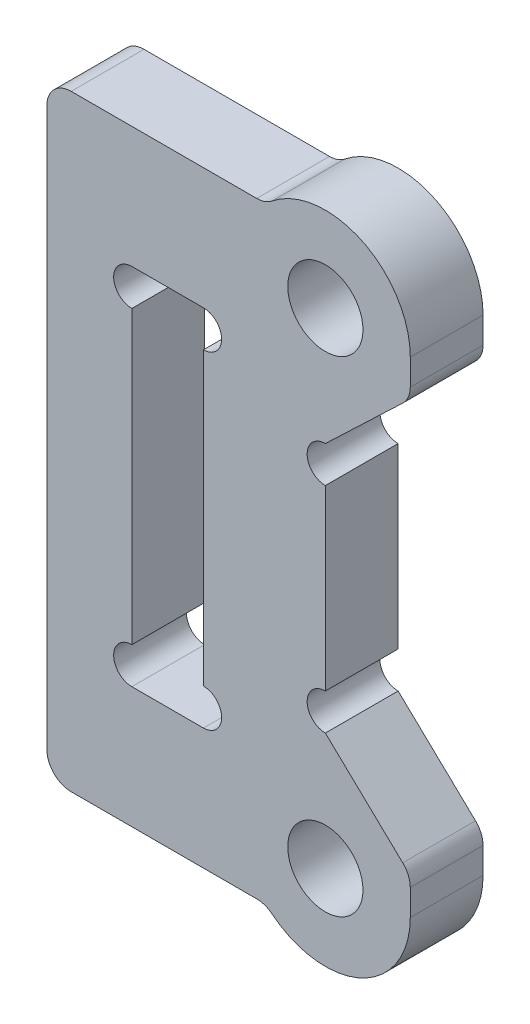
ISO-10303-21;
HEADER;
FILE_DESCRIPTION(('STEP AP214'),'2;1');
FILE_NAME('part.step','',(''),(''),'','','');
FILE_SCHEMA(('AUTOMOTIVE_DESIGN { 1 0 10303 214 1 1 1 1 }'));
ENDSEC;
DATA;
#1=APPLICATION_CONTEXT('core data for automotive mechanical design processes');
#2=APPLICATION_PROTOCOL_DEFINITION('international standard','automotive_design',2000,#1);
#3=PRODUCT_CONTEXT('',#1,'mechanical');
#4=PRODUCT('Part','Part','',(#3));
#5=PRODUCT_RELATED_PRODUCT_CATEGORY('part','',(#4));
#6=PRODUCT_DEFINITION_FORMATION('','',#4);
#7=PRODUCT_DEFINITION_CONTEXT('part definition',#1,'design');
#8=PRODUCT_DEFINITION('design','',#6,#7);
#9=PRODUCT_DEFINITION_SHAPE('','',#8);
#10=(LENGTH_UNIT() NAMED_UNIT(*) SI_UNIT(.MILLI.,.METRE.));
#11=(NAMED_UNIT(*) PLANE_ANGLE_UNIT() SI_UNIT($,.RADIAN.));
#12=(NAMED_UNIT(*) SI_UNIT($,.STERADIAN.) SOLID_ANGLE_UNIT());
#13=UNCERTAINTY_MEASURE_WITH_UNIT(LENGTH_MEASURE(1.E-05),#10,'distance_accuracy_value','');
#14=(GEOMETRIC_REPRESENTATION_CONTEXT(3) GLOBAL_UNCERTAINTY_ASSIGNED_CONTEXT((#13)) GLOBAL_UNIT_ASSIGNED_CONTEXT((#10,
#11,#12)) REPRESENTATION_CONTEXT('',''));
#15=CARTESIAN_POINT('',(0.,0.,0.));
#16=DIRECTION('',(0.,0.,1.));
#17=DIRECTION('',(1.,0.,0.));
#18=AXIS2_PLACEMENT_3D('',#15,#16,#17);
#19=CARTESIAN_POINT('',(3.5,10.,1.5));
#20=DIRECTION('',(-1.,0.,0.));
#21=DIRECTION('',(0.,-1.,0.));
#22=AXIS2_PLACEMENT_3D('',#19,#20,#21);
#23=PLANE('',#22);
#24=DIRECTION('',(0.,1.,0.));
#25=VECTOR('',#24,1.);
#26=CARTESIAN_POINT('',(3.5,10.,-1.5));
#27=LINE('',#26,#25);
#28=CARTESIAN_POINT('',(3.5,-10.,-1.5));
#29=VERTEX_POINT('',#28);
#30=CARTESIAN_POINT('',(3.5,-8.92857142857143,-1.5));
#31=VERTEX_POINT('',#30);
#32=EDGE_CURVE('E349',#29,#31,#27,.T.);
#33=ORIENTED_EDGE('',*,*,#32,.T.);
#34=DIRECTION('',(0.,0.,1.));
#35=VECTOR('',#34,1.);
#36=CARTESIAN_POINT('',(3.5,-8.92857142857143,1.5));
#37=LINE('',#36,#35);
#38=CARTESIAN_POINT('',(3.5,-8.92857142857143,1.5));
#39=VERTEX_POINT('',#38);
#40=EDGE_CURVE('E391',#31,#39,#37,.T.);
#41=ORIENTED_EDGE('',*,*,#40,.T.);
#42=DIRECTION('',(0.,1.,0.));
#43=VECTOR('',#42,1.);
#44=CARTESIAN_POINT('',(3.5,10.,1.5));
#45=LINE('',#44,#43);
#46=CARTESIAN_POINT('',(3.5,-10.,1.5));
#47=VERTEX_POINT('',#46);
#48=EDGE_CURVE('E332',#47,#39,#45,.T.);
#49=ORIENTED_EDGE('',*,*,#48,.F.);
#50=DIRECTION('',(0.,0.,-1.));
#51=VECTOR('',#50,1.);
#52=CARTESIAN_POINT('',(3.5,-10.,1.5));
#53=LINE('',#52,#51);
#54=EDGE_CURVE('E360',#47,#29,#53,.T.);
#55=ORIENTED_EDGE('',*,*,#54,.T.);
#56=EDGE_LOOP('',(#33,#41,#49,#55));
#57=FACE_BOUND('',#56,.T.);
#58=ADVANCED_FACE('F37',(#57),#23,.F.);
#59=CARTESIAN_POINT('',(0.,-10.,1.5));
#60=DIRECTION('',(0.,0.,1.));
#61=DIRECTION('',(1.,0.,0.));
#62=AXIS2_PLACEMENT_3D('',#59,#60,#61);
#63=PLANE('',#62);
#64=ORIENTED_EDGE('',*,*,#48,.T.);
#65=CARTESIAN_POINT('',(2.5,-8.92857142857143,1.5));
#66=DIRECTION('',(0.,0.,1.));
#67=DIRECTION('',(1.,0.,0.));
#68=AXIS2_PLACEMENT_3D('',#65,#66,#67);
#69=CIRCLE('',#68,1.);
#70=CARTESIAN_POINT('',(3.18965517241379,-8.20443349753695,1.5));
#71=VERTEX_POINT('',#70);
#72=EDGE_CURVE('E396',#39,#71,#69,.T.);
#73=ORIENTED_EDGE('',*,*,#72,.T.);
#74=DIRECTION('',(0.724137931034483,-0.689655172413793,0.));
#75=VECTOR('',#74,1.);
#76=CARTESIAN_POINT('',(0.,-5.16666666666667,1.5));
#77=LINE('',#76,#75);
#78=CARTESIAN_POINT('',(0.,-5.16666666666667,1.5));
#79=VERTEX_POINT('',#78);
#80=EDGE_CURVE('E240',#79,#71,#77,.T.);
#81=ORIENTED_EDGE('',*,*,#80,.F.);
#82=CARTESIAN_POINT('',(0.,-4.41666666666667,1.5));
#83=DIRECTION('',(0.,0.,1.));
#84=DIRECTION('',(1.,0.,0.));
#85=AXIS2_PLACEMENT_3D('',#82,#83,#84);
#86=CIRCLE('',#85,0.75);
#87=CARTESIAN_POINT('',(0.,-3.66666666666667,1.5));
#88=VERTEX_POINT('',#87);
#89=EDGE_CURVE('E471',#88,#79,#86,.T.);
#90=ORIENTED_EDGE('',*,*,#89,.F.);
#91=DIRECTION('',(0.,-1.,0.));
#92=VECTOR('',#91,1.);
#93=CARTESIAN_POINT('',(0.,5.16666666666667,1.5));
#94=LINE('',#93,#92);
#95=CARTESIAN_POINT('',(0.,3.66666666666667,1.5));
#96=VERTEX_POINT('',#95);
#97=EDGE_CURVE('E244',#96,#88,#94,.T.);
#98=ORIENTED_EDGE('',*,*,#97,.F.);
#99=CARTESIAN_POINT('',(0.,4.41666666666667,1.5));
#100=DIRECTION('',(0.,0.,1.));
#101=DIRECTION('',(1.,0.,0.));
#102=AXIS2_PLACEMENT_3D('',#99,#100,#101);
#103=CIRCLE('',#102,0.75);
#104=CARTESIAN_POINT('',(0.,5.16666666666667,1.5));
#105=VERTEX_POINT('',#104);
#106=EDGE_CURVE('E217',#105,#96,#103,.T.);
#107=ORIENTED_EDGE('',*,*,#106,.F.);
#108=DIRECTION('',(-0.724137931034483,-0.689655172413793,0.));
#109=VECTOR('',#108,1.);
#110=CARTESIAN_POINT('',(3.5,8.5,1.5));
#111=LINE('',#110,#109);
#112=CARTESIAN_POINT('',(3.18965517241379,8.20443349753694,1.5));
#113=VERTEX_POINT('',#112);
#114=EDGE_CURVE('E222',#113,#105,#111,.T.);
#115=ORIENTED_EDGE('',*,*,#114,.F.);
#116=CARTESIAN_POINT('',(2.5,8.92857142857143,1.5));
#117=DIRECTION('',(0.,0.,1.));
#118=DIRECTION('',(1.,0.,0.));
#119=AXIS2_PLACEMENT_3D('',#116,#117,#118);
#120=CIRCLE('',#119,1.);
#121=CARTESIAN_POINT('',(3.5,8.92857142857143,1.5));
#122=VERTEX_POINT('',#121);
#123=EDGE_CURVE('E394',#113,#122,#120,.T.);
#124=ORIENTED_EDGE('',*,*,#123,.T.);
#125=CARTESIAN_POINT('',(3.5,10.,1.5));
#126=VERTEX_POINT('',#125);
#127=EDGE_CURVE('E331',#122,#126,#45,.T.);
#128=ORIENTED_EDGE('',*,*,#127,.T.);
#129=CARTESIAN_POINT('',(0.,10.,1.5));
#130=DIRECTION('',(0.,0.,1.));
#131=DIRECTION('',(1.,0.,0.));
#132=AXIS2_PLACEMENT_3D('',#129,#130,#131);
#133=CIRCLE('',#132,3.5);
#134=CARTESIAN_POINT('',(-2.19988776369148,12.7222222222222,1.5));
#135=VERTEX_POINT('',#134);
#136=EDGE_CURVE('E335',#126,#135,#133,.T.);
#137=ORIENTED_EDGE('',*,*,#136,.T.);
#138=CARTESIAN_POINT('',(-2.82842712474619,13.5,1.5));
#139=DIRECTION('',(0.,0.,1.));
#140=DIRECTION('',(1.,0.,0.));
#141=AXIS2_PLACEMENT_3D('',#138,#139,#140);
#142=CIRCLE('',#141,1.);
#143=CARTESIAN_POINT('',(-2.82842712474619,12.5,1.5));
#144=VERTEX_POINT('',#143);
#145=EDGE_CURVE('E11',#135,#144,#142,.F.);
#146=ORIENTED_EDGE('',*,*,#145,.T.);
#147=DIRECTION('',(-1.,0.,0.));
#148=VECTOR('',#147,1.);
#149=CARTESIAN_POINT('',(-2.44948974278318,12.5,1.5));
#150=LINE('',#149,#148);
#151=CARTESIAN_POINT('',(-10.475,12.5,1.5));
#152=VERTEX_POINT('',#151);
#153=EDGE_CURVE('E338',#144,#152,#150,.T.);
#154=ORIENTED_EDGE('',*,*,#153,.T.);
#155=CARTESIAN_POINT('',(-10.475,11.5,1.5));
#156=DIRECTION('',(0.,0.,1.));
#157=DIRECTION('',(1.,0.,0.));
#158=AXIS2_PLACEMENT_3D('',#155,#156,#157);
#159=CIRCLE('',#158,1.);
#160=CARTESIAN_POINT('',(-11.475,11.5,1.5));
#161=VERTEX_POINT('',#160);
#162=EDGE_CURVE('E376',#152,#161,#159,.T.);
#163=ORIENTED_EDGE('',*,*,#162,.T.);
#164=DIRECTION('',(0.,-1.,0.));
#165=VECTOR('',#164,1.);
#166=CARTESIAN_POINT('',(-11.475,12.5,1.5));
#167=LINE('',#166,#165);
#168=CARTESIAN_POINT('',(-11.475,-11.5,1.5));
#169=VERTEX_POINT('',#168);
#170=EDGE_CURVE('E340',#161,#169,#167,.T.);
#171=ORIENTED_EDGE('',*,*,#170,.T.);
#172=CARTESIAN_POINT('',(-10.475,-11.5,1.5));
#173=DIRECTION('',(0.,0.,1.));
#174=DIRECTION('',(1.,0.,0.));
#175=AXIS2_PLACEMENT_3D('',#172,#173,#174);
#176=CIRCLE('',#175,1.);
#177=CARTESIAN_POINT('',(-10.475,-12.5,1.5));
#178=VERTEX_POINT('',#177);
#179=EDGE_CURVE('E378',#169,#178,#176,.T.);
#180=ORIENTED_EDGE('',*,*,#179,.T.);
#181=DIRECTION('',(1.,0.,0.));
#182=VECTOR('',#181,1.);
#183=CARTESIAN_POINT('',(-11.475,-12.5,1.5));
#184=LINE('',#183,#182);
#185=CARTESIAN_POINT('',(-2.82842712474619,-12.5,1.5));
#186=VERTEX_POINT('',#185);
#187=EDGE_CURVE('E325',#178,#186,#184,.T.);
#188=ORIENTED_EDGE('',*,*,#187,.T.);
#189=CARTESIAN_POINT('',(-2.82842712474619,-13.5,1.5));
#190=DIRECTION('',(0.,0.,1.));
#191=DIRECTION('',(1.,0.,0.));
#192=AXIS2_PLACEMENT_3D('',#189,#190,#191);
#193=CIRCLE('',#192,1.);
#194=CARTESIAN_POINT('',(-2.19988776369148,-12.7222222222222,1.5));
#195=VERTEX_POINT('',#194);
#196=EDGE_CURVE('E415',#186,#195,#193,.F.);
#197=ORIENTED_EDGE('',*,*,#196,.T.);
#198=CARTESIAN_POINT('',(0.,-10.,1.5));
#199=DIRECTION('',(0.,0.,1.));
#200=DIRECTION('',(1.,0.,0.));
#201=AXIS2_PLACEMENT_3D('',#198,#199,#200);
#202=CIRCLE('',#201,3.5);
#203=EDGE_CURVE('E328',#195,#47,#202,.T.);
#204=ORIENTED_EDGE('',*,*,#203,.T.);
#205=EDGE_LOOP('',(#64,#73,#81,#90,#98,#107,#115,#124,#128,#137,#146,#154,#163,#171,#180,#188,
#197,#204));
#206=FACE_BOUND('',#205,.T.);
#207=CARTESIAN_POINT('',(-5.02500000000001,6.75,1.5));
#208=DIRECTION('',(0.,0.,1.));
#209=DIRECTION('',(1.,0.,0.));
#210=AXIS2_PLACEMENT_3D('',#207,#208,#209);
#211=CIRCLE('',#210,0.749999999999999);
#212=CARTESIAN_POINT('',(-5.02500000000001,6.,1.5));
#213=VERTEX_POINT('',#212);
#214=CARTESIAN_POINT('',(-5.02500000000001,7.5,1.5));
#215=VERTEX_POINT('',#214);
#216=EDGE_CURVE('E262',#213,#215,#211,.T.);
#217=ORIENTED_EDGE('',*,*,#216,.F.);
#218=DIRECTION('',(0.,1.,0.));
#219=VECTOR('',#218,1.);
#220=CARTESIAN_POINT('',(-5.02500000000001,-7.5,1.5));
#221=LINE('',#220,#219);
#222=CARTESIAN_POINT('',(-5.02500000000001,-6.,1.5));
#223=VERTEX_POINT('',#222);
#224=EDGE_CURVE('E286',#223,#213,#221,.T.);
#225=ORIENTED_EDGE('',*,*,#224,.F.);
#226=CARTESIAN_POINT('',(-5.02500000000001,-6.75,1.5));
#227=DIRECTION('',(0.,0.,1.));
#228=DIRECTION('',(1.,0.,0.));
#229=AXIS2_PLACEMENT_3D('',#226,#227,#228);
#230=CIRCLE('',#229,0.75);
#231=CARTESIAN_POINT('',(-5.02500000000001,-7.5,1.5));
#232=VERTEX_POINT('',#231);
#233=EDGE_CURVE('E251',#232,#223,#230,.T.);
#234=ORIENTED_EDGE('',*,*,#233,.F.);
#235=DIRECTION('',(1.,0.,0.));
#236=VECTOR('',#235,1.);
#237=CARTESIAN_POINT('',(-5.02500000000001,-7.5,1.5));
#238=LINE('',#237,#236);
#239=CARTESIAN_POINT('',(-7.97500000000001,-7.5,1.5));
#240=VERTEX_POINT('',#239);
#241=EDGE_CURVE('E282',#240,#232,#238,.T.);
#242=ORIENTED_EDGE('',*,*,#241,.F.);
#243=CARTESIAN_POINT('',(-7.97500000000001,-6.75,1.5));
#244=DIRECTION('',(0.,0.,1.));
#245=DIRECTION('',(1.,0.,0.));
#246=AXIS2_PLACEMENT_3D('',#243,#244,#245);
#247=CIRCLE('',#246,0.75);
#248=CARTESIAN_POINT('',(-7.97500000000001,-6.,1.5));
#249=VERTEX_POINT('',#248);
#250=EDGE_CURVE('E256',#249,#240,#247,.T.);
#251=ORIENTED_EDGE('',*,*,#250,.F.);
#252=DIRECTION('',(0.,-1.,0.));
#253=VECTOR('',#252,1.);
#254=CARTESIAN_POINT('',(-7.97500000000001,-7.5,1.5));
#255=LINE('',#254,#253);
#256=CARTESIAN_POINT('',(-7.97500000000001,6.,1.5));
#257=VERTEX_POINT('',#256);
#258=EDGE_CURVE('E279',#257,#249,#255,.T.);
#259=ORIENTED_EDGE('',*,*,#258,.F.);
#260=CARTESIAN_POINT('',(-7.97500000000001,6.75,1.5));
#261=DIRECTION('',(0.,0.,1.));
#262=DIRECTION('',(1.,0.,0.));
#263=AXIS2_PLACEMENT_3D('',#260,#261,#262);
#264=CIRCLE('',#263,0.749999999999998);
#265=CARTESIAN_POINT('',(-7.97500000000001,7.5,1.5));
#266=VERTEX_POINT('',#265);
#267=EDGE_CURVE('E261',#266,#257,#264,.T.);
#268=ORIENTED_EDGE('',*,*,#267,.F.);
#269=DIRECTION('',(-1.,0.,0.));
#270=VECTOR('',#269,1.);
#271=CARTESIAN_POINT('',(-5.02500000000001,7.5,1.5));
#272=LINE('',#271,#270);
#273=EDGE_CURVE('E289',#215,#266,#272,.T.);
#274=ORIENTED_EDGE('',*,*,#273,.F.);
#275=EDGE_LOOP('',(#217,#225,#234,#242,#251,#259,#268,#274));
#276=FACE_BOUND('',#275,.T.);
#277=CARTESIAN_POINT('',(0.,10.,1.5));
#278=DIRECTION('',(0.,0.,1.));
#279=DIRECTION('',(1.,0.,0.));
#280=AXIS2_PLACEMENT_3D('',#277,#278,#279);
#281=CIRCLE('',#280,1.55);
#282=CARTESIAN_POINT('',(1.55,10.,1.5));
#283=VERTEX_POINT('',#282);
#284=EDGE_CURVE('E319',#283,#283,#281,.T.);
#285=ORIENTED_EDGE('',*,*,#284,.F.);
#286=EDGE_LOOP('',(#285));
#287=FACE_BOUND('',#286,.T.);
#288=CARTESIAN_POINT('',(0.,-10.,1.5));
#289=DIRECTION('',(0.,0.,1.));
#290=DIRECTION('',(1.,0.,0.));
#291=AXIS2_PLACEMENT_3D('',#288,#289,#290);
#292=CIRCLE('',#291,1.55);
#293=CARTESIAN_POINT('',(1.55,-10.,1.5));
#294=VERTEX_POINT('',#293);
#295=EDGE_CURVE('E313',#294,#294,#292,.T.);
#296=ORIENTED_EDGE('',*,*,#295,.F.);
#297=EDGE_LOOP('',(#296));
#298=FACE_BOUND('',#297,.T.);
#299=ADVANCED_FACE('F419',(#206,#276,#287,#298),#63,.T.);
#300=CARTESIAN_POINT('',(0.,-10.,-1.5));
#301=DIRECTION('',(0.,0.,1.));
#302=DIRECTION('',(1.,0.,0.));
#303=AXIS2_PLACEMENT_3D('',#300,#301,#302);
#304=PLANE('',#303);
#305=CARTESIAN_POINT('',(0.,-10.,-1.5));
#306=DIRECTION('',(0.,0.,1.));
#307=DIRECTION('',(1.,0.,0.));
#308=AXIS2_PLACEMENT_3D('',#305,#306,#307);
#309=CIRCLE('',#308,1.55);
#310=CARTESIAN_POINT('',(1.55,-10.,-1.5));
#311=VERTEX_POINT('',#310);
#312=EDGE_CURVE('E312',#311,#311,#309,.T.);
#313=ORIENTED_EDGE('',*,*,#312,.T.);
#314=EDGE_LOOP('',(#313));
#315=FACE_BOUND('',#314,.T.);
#316=CARTESIAN_POINT('',(0.,10.,-1.5));
#317=DIRECTION('',(0.,0.,1.));
#318=DIRECTION('',(1.,0.,0.));
#319=AXIS2_PLACEMENT_3D('',#316,#317,#318);
#320=CIRCLE('',#319,1.55);
#321=CARTESIAN_POINT('',(1.55,10.,-1.5));
#322=VERTEX_POINT('',#321);
#323=EDGE_CURVE('E316',#322,#322,#320,.T.);
#324=ORIENTED_EDGE('',*,*,#323,.T.);
#325=EDGE_LOOP('',(#324));
#326=FACE_BOUND('',#325,.T.);
#327=DIRECTION('',(0.724137931034483,-0.689655172413793,0.));
#328=VECTOR('',#327,1.);
#329=CARTESIAN_POINT('',(0.,-5.16666666666667,-1.5));
#330=LINE('',#329,#328);
#331=CARTESIAN_POINT('',(0.,-5.16666666666667,-1.5));
#332=VERTEX_POINT('',#331);
#333=CARTESIAN_POINT('',(3.18965517241379,-8.20443349753695,-1.5));
#334=VERTEX_POINT('',#333);
#335=EDGE_CURVE('E236',#332,#334,#330,.T.);
#336=ORIENTED_EDGE('',*,*,#335,.T.);
#337=CARTESIAN_POINT('',(2.5,-8.92857142857143,-1.5));
#338=DIRECTION('',(0.,0.,1.));
#339=DIRECTION('',(1.,0.,0.));
#340=AXIS2_PLACEMENT_3D('',#337,#338,#339);
#341=CIRCLE('',#340,1.);
#342=EDGE_CURVE('E402',#334,#31,#341,.F.);
#343=ORIENTED_EDGE('',*,*,#342,.T.);
#344=ORIENTED_EDGE('',*,*,#32,.F.);
#345=CARTESIAN_POINT('',(0.,-10.,-1.5));
#346=DIRECTION('',(0.,0.,1.));
#347=DIRECTION('',(1.,0.,0.));
#348=AXIS2_PLACEMENT_3D('',#345,#346,#347);
#349=CIRCLE('',#348,3.5);
#350=CARTESIAN_POINT('',(-2.19988776369148,-12.7222222222222,-1.5));
#351=VERTEX_POINT('',#350);
#352=EDGE_CURVE('E346',#351,#29,#349,.T.);
#353=ORIENTED_EDGE('',*,*,#352,.F.);
#354=CARTESIAN_POINT('',(-2.82842712474619,-13.5,-1.5));
#355=DIRECTION('',(0.,0.,1.));
#356=DIRECTION('',(1.,0.,0.));
#357=AXIS2_PLACEMENT_3D('',#354,#355,#356);
#358=CIRCLE('',#357,1.);
#359=CARTESIAN_POINT('',(-2.82842712474619,-12.5,-1.5));
#360=VERTEX_POINT('',#359);
#361=EDGE_CURVE('E413',#351,#360,#358,.T.);
#362=ORIENTED_EDGE('',*,*,#361,.T.);
#363=DIRECTION('',(1.,0.,0.));
#364=VECTOR('',#363,1.);
#365=CARTESIAN_POINT('',(-11.475,-12.5,-1.5));
#366=LINE('',#365,#364);
#367=CARTESIAN_POINT('',(-10.475,-12.5,-1.5));
#368=VERTEX_POINT('',#367);
#369=EDGE_CURVE('E322',#368,#360,#366,.T.);
#370=ORIENTED_EDGE('',*,*,#369,.F.);
#371=CARTESIAN_POINT('',(-10.475,-11.5,-1.5));
#372=DIRECTION('',(0.,0.,1.));
#373=DIRECTION('',(1.,0.,0.));
#374=AXIS2_PLACEMENT_3D('',#371,#372,#373);
#375=CIRCLE('',#374,1.);
#376=CARTESIAN_POINT('',(-11.475,-11.5,-1.5));
#377=VERTEX_POINT('',#376);
#378=EDGE_CURVE('E369',#368,#377,#375,.F.);
#379=ORIENTED_EDGE('',*,*,#378,.T.);
#380=DIRECTION('',(0.,-1.,0.));
#381=VECTOR('',#380,1.);
#382=CARTESIAN_POINT('',(-11.475,12.5,-1.5));
#383=LINE('',#382,#381);
#384=CARTESIAN_POINT('',(-11.475,11.5,-1.5));
#385=VERTEX_POINT('',#384);
#386=EDGE_CURVE('E329',#385,#377,#383,.T.);
#387=ORIENTED_EDGE('',*,*,#386,.F.);
#388=CARTESIAN_POINT('',(-10.475,11.5,-1.5));
#389=DIRECTION('',(0.,0.,1.));
#390=DIRECTION('',(1.,0.,0.));
#391=AXIS2_PLACEMENT_3D('',#388,#389,#390);
#392=CIRCLE('',#391,1.);
#393=CARTESIAN_POINT('',(-10.475,12.5,-1.5));
#394=VERTEX_POINT('',#393);
#395=EDGE_CURVE('E366',#385,#394,#392,.F.);
#396=ORIENTED_EDGE('',*,*,#395,.T.);
#397=DIRECTION('',(-1.,0.,0.));
#398=VECTOR('',#397,1.);
#399=CARTESIAN_POINT('',(-2.44948974278318,12.5,-1.5));
#400=LINE('',#399,#398);
#401=CARTESIAN_POINT('',(-2.82842712474619,12.5,-1.5));
#402=VERTEX_POINT('',#401);
#403=EDGE_CURVE('E354',#402,#394,#400,.T.);
#404=ORIENTED_EDGE('',*,*,#403,.F.);
#405=CARTESIAN_POINT('',(-2.82842712474619,13.5,-1.5));
#406=DIRECTION('',(0.,0.,1.));
#407=DIRECTION('',(1.,0.,0.));
#408=AXIS2_PLACEMENT_3D('',#405,#406,#407);
#409=CIRCLE('',#408,1.);
#410=CARTESIAN_POINT('',(-2.19988776369148,12.7222222222222,-1.5));
#411=VERTEX_POINT('',#410);
#412=EDGE_CURVE('E45',#402,#411,#409,.T.);
#413=ORIENTED_EDGE('',*,*,#412,.T.);
#414=CARTESIAN_POINT('',(0.,10.,-1.5));
#415=DIRECTION('',(0.,0.,1.));
#416=DIRECTION('',(1.,0.,0.));
#417=AXIS2_PLACEMENT_3D('',#414,#415,#416);
#418=CIRCLE('',#417,3.5);
#419=CARTESIAN_POINT('',(3.5,10.,-1.5));
#420=VERTEX_POINT('',#419);
#421=EDGE_CURVE('E352',#420,#411,#418,.T.);
#422=ORIENTED_EDGE('',*,*,#421,.F.);
#423=CARTESIAN_POINT('',(3.5,8.92857142857143,-1.5));
#424=VERTEX_POINT('',#423);
#425=EDGE_CURVE('E348',#424,#420,#27,.T.);
#426=ORIENTED_EDGE('',*,*,#425,.F.);
#427=CARTESIAN_POINT('',(2.5,8.92857142857143,-1.5));
#428=DIRECTION('',(0.,0.,1.));
#429=DIRECTION('',(1.,0.,0.));
#430=AXIS2_PLACEMENT_3D('',#427,#428,#429);
#431=CIRCLE('',#430,1.);
#432=CARTESIAN_POINT('',(3.18965517241379,8.20443349753694,-1.5));
#433=VERTEX_POINT('',#432);
#434=EDGE_CURVE('E400',#424,#433,#431,.F.);
#435=ORIENTED_EDGE('',*,*,#434,.T.);
#436=DIRECTION('',(-0.724137931034483,-0.689655172413793,0.));
#437=VECTOR('',#436,1.);
#438=CARTESIAN_POINT('',(3.5,8.5,-1.5));
#439=LINE('',#438,#437);
#440=CARTESIAN_POINT('',(0.,5.16666666666667,-1.5));
#441=VERTEX_POINT('',#440);
#442=EDGE_CURVE('E231',#433,#441,#439,.T.);
#443=ORIENTED_EDGE('',*,*,#442,.T.);
#444=CARTESIAN_POINT('',(0.,4.41666666666667,-1.5));
#445=DIRECTION('',(0.,0.,1.));
#446=DIRECTION('',(1.,0.,0.));
#447=AXIS2_PLACEMENT_3D('',#444,#445,#446);
#448=CIRCLE('',#447,0.75);
#449=CARTESIAN_POINT('',(0.,3.66666666666667,-1.5));
#450=VERTEX_POINT('',#449);
#451=EDGE_CURVE('E214',#441,#450,#448,.T.);
#452=ORIENTED_EDGE('',*,*,#451,.T.);
#453=DIRECTION('',(0.,-1.,0.));
#454=VECTOR('',#453,1.);
#455=CARTESIAN_POINT('',(0.,5.16666666666667,-1.5));
#456=LINE('',#455,#454);
#457=CARTESIAN_POINT('',(0.,-3.66666666666667,-1.5));
#458=VERTEX_POINT('',#457);
#459=EDGE_CURVE('E229',#450,#458,#456,.T.);
#460=ORIENTED_EDGE('',*,*,#459,.T.);
#461=CARTESIAN_POINT('',(0.,-4.41666666666667,-1.5));
#462=DIRECTION('',(0.,0.,1.));
#463=DIRECTION('',(1.,0.,0.));
#464=AXIS2_PLACEMENT_3D('',#461,#462,#463);
#465=CIRCLE('',#464,0.75);
#466=EDGE_CURVE('E469',#458,#332,#465,.T.);
#467=ORIENTED_EDGE('',*,*,#466,.T.);
#468=EDGE_LOOP('',(#336,#343,#344,#353,#362,#370,#379,#387,#396,#404,#413,#422,#426,#435,#443,
#452,#460,#467));
#469=FACE_BOUND('',#468,.T.);
#470=DIRECTION('',(0.,1.,0.));
#471=VECTOR('',#470,1.);
#472=CARTESIAN_POINT('',(-5.02500000000001,-7.5,-1.5));
#473=LINE('',#472,#471);
#474=CARTESIAN_POINT('',(-5.02500000000001,-6.,-1.5));
#475=VERTEX_POINT('',#474);
#476=CARTESIAN_POINT('',(-5.02500000000001,6.,-1.5));
#477=VERTEX_POINT('',#476);
#478=EDGE_CURVE('E298',#475,#477,#473,.T.);
#479=ORIENTED_EDGE('',*,*,#478,.T.);
#480=CARTESIAN_POINT('',(-5.02500000000001,6.75,-1.5));
#481=DIRECTION('',(0.,0.,1.));
#482=DIRECTION('',(1.,0.,0.));
#483=AXIS2_PLACEMENT_3D('',#480,#481,#482);
#484=CIRCLE('',#483,0.749999999999999);
#485=CARTESIAN_POINT('',(-5.02500000000001,7.5,-1.5));
#486=VERTEX_POINT('',#485);
#487=EDGE_CURVE('E258',#477,#486,#484,.T.);
#488=ORIENTED_EDGE('',*,*,#487,.T.);
#489=DIRECTION('',(-1.,0.,0.));
#490=VECTOR('',#489,1.);
#491=CARTESIAN_POINT('',(-5.02500000000001,7.5,-1.5));
#492=LINE('',#491,#490);
#493=CARTESIAN_POINT('',(-7.97500000000001,7.5,-1.5));
#494=VERTEX_POINT('',#493);
#495=EDGE_CURVE('E283',#486,#494,#492,.T.);
#496=ORIENTED_EDGE('',*,*,#495,.T.);
#497=CARTESIAN_POINT('',(-7.97500000000001,6.75,-1.5));
#498=DIRECTION('',(0.,0.,1.));
#499=DIRECTION('',(1.,0.,0.));
#500=AXIS2_PLACEMENT_3D('',#497,#498,#499);
#501=CIRCLE('',#500,0.749999999999998);
#502=CARTESIAN_POINT('',(-7.97500000000001,6.,-1.5));
#503=VERTEX_POINT('',#502);
#504=EDGE_CURVE('E268',#494,#503,#501,.T.);
#505=ORIENTED_EDGE('',*,*,#504,.T.);
#506=DIRECTION('',(0.,-1.,0.));
#507=VECTOR('',#506,1.);
#508=CARTESIAN_POINT('',(-7.97500000000001,-7.5,-1.5));
#509=LINE('',#508,#507);
#510=CARTESIAN_POINT('',(-7.97500000000001,-6.,-1.5));
#511=VERTEX_POINT('',#510);
#512=EDGE_CURVE('E278',#503,#511,#509,.T.);
#513=ORIENTED_EDGE('',*,*,#512,.T.);
#514=CARTESIAN_POINT('',(-7.97500000000001,-6.75,-1.5));
#515=DIRECTION('',(0.,0.,1.));
#516=DIRECTION('',(1.,0.,0.));
#517=AXIS2_PLACEMENT_3D('',#514,#515,#516);
#518=CIRCLE('',#517,0.75);
#519=CARTESIAN_POINT('',(-7.97500000000001,-7.5,-1.5));
#520=VERTEX_POINT('',#519);
#521=EDGE_CURVE('E264',#511,#520,#518,.T.);
#522=ORIENTED_EDGE('',*,*,#521,.T.);
#523=DIRECTION('',(1.,0.,0.));
#524=VECTOR('',#523,1.);
#525=CARTESIAN_POINT('',(-5.02500000000001,-7.5,-1.5));
#526=LINE('',#525,#524);
#527=CARTESIAN_POINT('',(-5.02500000000001,-7.5,-1.5));
#528=VERTEX_POINT('',#527);
#529=EDGE_CURVE('E295',#520,#528,#526,.T.);
#530=ORIENTED_EDGE('',*,*,#529,.T.);
#531=CARTESIAN_POINT('',(-5.02500000000001,-6.75,-1.5));
#532=DIRECTION('',(0.,0.,1.));
#533=DIRECTION('',(1.,0.,0.));
#534=AXIS2_PLACEMENT_3D('',#531,#532,#533);
#535=CIRCLE('',#534,0.75);
#536=EDGE_CURVE('E253',#528,#475,#535,.T.);
#537=ORIENTED_EDGE('',*,*,#536,.T.);
#538=EDGE_LOOP('',(#479,#488,#496,#505,#513,#522,#530,#537));
#539=FACE_BOUND('',#538,.T.);
#540=ADVANCED_FACE('F226',(#315,#326,#469,#539),#304,.F.);
#541=CARTESIAN_POINT('',(-11.475,-12.5,1.5));
#542=DIRECTION('',(0.,1.,0.));
#543=DIRECTION('',(-1.,0.,0.));
#544=AXIS2_PLACEMENT_3D('',#541,#542,#543);
#545=PLANE('',#544);
#546=ORIENTED_EDGE('',*,*,#369,.T.);
#547=DIRECTION('',(0.,0.,1.));
#548=VECTOR('',#547,1.);
#549=CARTESIAN_POINT('',(-2.82842712474619,-12.5,1.5));
#550=LINE('',#549,#548);
#551=EDGE_CURVE('E389',#360,#186,#550,.T.);
#552=ORIENTED_EDGE('',*,*,#551,.T.);
#553=ORIENTED_EDGE('',*,*,#187,.F.);
#554=DIRECTION('',(0.,0.,-1.));
#555=VECTOR('',#554,1.);
#556=CARTESIAN_POINT('',(-10.475,-12.5,1.5));
#557=LINE('',#556,#555);
#558=EDGE_CURVE('E363',#178,#368,#557,.T.);
#559=ORIENTED_EDGE('',*,*,#558,.T.);
#560=EDGE_LOOP('',(#546,#552,#553,#559));
#561=FACE_BOUND('',#560,.T.);
#562=ADVANCED_FACE('F434',(#561),#545,.F.);
#563=CARTESIAN_POINT('',(0.,-10.,1.5));
#564=DIRECTION('',(0.,0.,-1.));
#565=DIRECTION('',(-1.,0.,0.));
#566=AXIS2_PLACEMENT_3D('',#563,#564,#565);
#567=CYLINDRICAL_SURFACE('',#566,3.5);
#568=ORIENTED_EDGE('',*,*,#203,.F.);
#569=DIRECTION('',(0.,0.,-1.));
#570=VECTOR('',#569,1.);
#571=CARTESIAN_POINT('',(-2.19988776369148,-12.7222222222222,1.5));
#572=LINE('',#571,#570);
#573=EDGE_CURVE('E386',#195,#351,#572,.T.);
#574=ORIENTED_EDGE('',*,*,#573,.T.);
#575=ORIENTED_EDGE('',*,*,#352,.T.);
#576=ORIENTED_EDGE('',*,*,#54,.F.);
#577=EDGE_LOOP('',(#568,#574,#575,#576));
#578=FACE_BOUND('',#577,.T.);
#579=ADVANCED_FACE('F427',(#578),#567,.T.);
#580=ORIENTED_EDGE('',*,*,#127,.F.);
#581=DIRECTION('',(0.,0.,1.));
#582=VECTOR('',#581,1.);
#583=CARTESIAN_POINT('',(3.5,8.92857142857143,1.5));
#584=LINE('',#583,#582);
#585=EDGE_CURVE('E52',#122,#424,#584,.F.);
#586=ORIENTED_EDGE('',*,*,#585,.T.);
#587=ORIENTED_EDGE('',*,*,#425,.T.);
#588=DIRECTION('',(0.,0.,-1.));
#589=VECTOR('',#588,1.);
#590=CARTESIAN_POINT('',(3.5,10.,1.5));
#591=LINE('',#590,#589);
#592=EDGE_CURVE('E343',#126,#420,#591,.T.);
#593=ORIENTED_EDGE('',*,*,#592,.F.);
#594=EDGE_LOOP('',(#580,#586,#587,#593));
#595=FACE_BOUND('',#594,.T.);
#596=ADVANCED_FACE('F461',(#595),#23,.F.);
#597=CARTESIAN_POINT('',(0.,10.,1.5));
#598=DIRECTION('',(0.,0.,-1.));
#599=DIRECTION('',(-1.,0.,0.));
#600=AXIS2_PLACEMENT_3D('',#597,#598,#599);
#601=CYLINDRICAL_SURFACE('',#600,3.5);
#602=ORIENTED_EDGE('',*,*,#421,.T.);
#603=DIRECTION('',(0.,0.,-1.));
#604=VECTOR('',#603,1.);
#605=CARTESIAN_POINT('',(-2.19988776369148,12.7222222222222,1.5));
#606=LINE('',#605,#604);
#607=EDGE_CURVE('E411',#411,#135,#606,.F.);
#608=ORIENTED_EDGE('',*,*,#607,.T.);
#609=ORIENTED_EDGE('',*,*,#136,.F.);
#610=ORIENTED_EDGE('',*,*,#592,.T.);
#611=EDGE_LOOP('',(#602,#608,#609,#610));
#612=FACE_BOUND('',#611,.T.);
#613=ADVANCED_FACE('F458',(#612),#601,.T.);
#614=CARTESIAN_POINT('',(-2.44948974278318,12.5,1.5));
#615=DIRECTION('',(0.,-1.,0.));
#616=DIRECTION('',(1.,0.,0.));
#617=AXIS2_PLACEMENT_3D('',#614,#615,#616);
#618=PLANE('',#617);
#619=ORIENTED_EDGE('',*,*,#153,.F.);
#620=DIRECTION('',(0.,0.,1.));
#621=VECTOR('',#620,1.);
#622=CARTESIAN_POINT('',(-2.82842712474619,12.5,-1.5));
#623=LINE('',#622,#621);
#624=EDGE_CURVE('E408',#144,#402,#623,.F.);
#625=ORIENTED_EDGE('',*,*,#624,.T.);
#626=ORIENTED_EDGE('',*,*,#403,.T.);
#627=DIRECTION('',(0.,0.,-1.));
#628=VECTOR('',#627,1.);
#629=CARTESIAN_POINT('',(-10.475,12.5,1.5));
#630=LINE('',#629,#628);
#631=EDGE_CURVE('E380',#394,#152,#630,.F.);
#632=ORIENTED_EDGE('',*,*,#631,.T.);
#633=EDGE_LOOP('',(#619,#625,#626,#632));
#634=FACE_BOUND('',#633,.T.);
#635=ADVANCED_FACE('F451',(#634),#618,.F.);
#636=CARTESIAN_POINT('',(-11.475,12.5,1.5));
#637=DIRECTION('',(1.,0.,0.));
#638=DIRECTION('',(0.,0.,-1.));
#639=AXIS2_PLACEMENT_3D('',#636,#637,#638);
#640=PLANE('',#639);
#641=ORIENTED_EDGE('',*,*,#386,.T.);
#642=DIRECTION('',(0.,0.,-1.));
#643=VECTOR('',#642,1.);
#644=CARTESIAN_POINT('',(-11.475,-11.5,1.5));
#645=LINE('',#644,#643);
#646=EDGE_CURVE('E374',#377,#169,#645,.F.);
#647=ORIENTED_EDGE('',*,*,#646,.T.);
#648=ORIENTED_EDGE('',*,*,#170,.F.);
#649=DIRECTION('',(0.,0.,-1.));
#650=VECTOR('',#649,1.);
#651=CARTESIAN_POINT('',(-11.475,11.5,1.5));
#652=LINE('',#651,#650);
#653=EDGE_CURVE('E371',#161,#385,#652,.T.);
#654=ORIENTED_EDGE('',*,*,#653,.T.);
#655=EDGE_LOOP('',(#641,#647,#648,#654));
#656=FACE_BOUND('',#655,.T.);
#657=ADVANCED_FACE('F442',(#656),#640,.F.);
#658=CARTESIAN_POINT('',(0.,10.,1.5));
#659=DIRECTION('',(0.,0.,-1.));
#660=DIRECTION('',(-1.,0.,0.));
#661=AXIS2_PLACEMENT_3D('',#658,#659,#660);
#662=CYLINDRICAL_SURFACE('',#661,1.55);
#663=ORIENTED_EDGE('',*,*,#284,.T.);
#664=EDGE_LOOP('',(#663));
#665=FACE_BOUND('',#664,.T.);
#666=ORIENTED_EDGE('',*,*,#323,.F.);
#667=EDGE_LOOP('',(#666));
#668=FACE_BOUND('',#667,.T.);
#669=ADVANCED_FACE('F724',(#665,#668),#662,.F.);
#670=CARTESIAN_POINT('',(0.,-10.,1.5));
#671=DIRECTION('',(0.,0.,-1.));
#672=DIRECTION('',(-1.,0.,0.));
#673=AXIS2_PLACEMENT_3D('',#670,#671,#672);
#674=CYLINDRICAL_SURFACE('',#673,1.55);
#675=ORIENTED_EDGE('',*,*,#295,.T.);
#676=EDGE_LOOP('',(#675));
#677=FACE_BOUND('',#676,.T.);
#678=ORIENTED_EDGE('',*,*,#312,.F.);
#679=EDGE_LOOP('',(#678));
#680=FACE_BOUND('',#679,.T.);
#681=ADVANCED_FACE('F704',(#677,#680),#674,.F.);
#682=CARTESIAN_POINT('',(-7.97500000000001,-7.5,1.5));
#683=DIRECTION('',(1.,0.,0.));
#684=DIRECTION('',(0.,0.,-1.));
#685=AXIS2_PLACEMENT_3D('',#682,#683,#684);
#686=PLANE('',#685);
#687=DIRECTION('',(0.,0.,1.));
#688=VECTOR('',#687,1.);
#689=CARTESIAN_POINT('',(-7.97500000000001,-6.,-1.5));
#690=LINE('',#689,#688);
#691=EDGE_CURVE('E276',#511,#249,#690,.T.);
#692=ORIENTED_EDGE('',*,*,#691,.F.);
#693=ORIENTED_EDGE('',*,*,#512,.F.);
#694=DIRECTION('',(0.,0.,1.));
#695=VECTOR('',#694,1.);
#696=CARTESIAN_POINT('',(-7.97500000000001,6.,-1.5));
#697=LINE('',#696,#695);
#698=EDGE_CURVE('E271',#257,#503,#697,.F.);
#699=ORIENTED_EDGE('',*,*,#698,.F.);
#700=ORIENTED_EDGE('',*,*,#258,.T.);
#701=EDGE_LOOP('',(#692,#693,#699,#700));
#702=FACE_BOUND('',#701,.T.);
#703=ADVANCED_FACE('F694',(#702),#686,.T.);
#704=CARTESIAN_POINT('',(-5.02500000000001,-7.5,1.5));
#705=DIRECTION('',(0.,1.,0.));
#706=DIRECTION('',(-1.,0.,0.));
#707=AXIS2_PLACEMENT_3D('',#704,#705,#706);
#708=PLANE('',#707);
#709=ORIENTED_EDGE('',*,*,#529,.F.);
#710=DIRECTION('',(0.,0.,-1.));
#711=VECTOR('',#710,1.);
#712=CARTESIAN_POINT('',(-7.97500000000001,-7.5,1.5));
#713=LINE('',#712,#711);
#714=EDGE_CURVE('E310',#240,#520,#713,.T.);
#715=ORIENTED_EDGE('',*,*,#714,.F.);
#716=ORIENTED_EDGE('',*,*,#241,.T.);
#717=DIRECTION('',(0.,0.,-1.));
#718=VECTOR('',#717,1.);
#719=CARTESIAN_POINT('',(-5.02500000000001,-7.5,1.5));
#720=LINE('',#719,#718);
#721=EDGE_CURVE('E307',#232,#528,#720,.T.);
#722=ORIENTED_EDGE('',*,*,#721,.T.);
#723=EDGE_LOOP('',(#709,#715,#716,#722));
#724=FACE_BOUND('',#723,.T.);
#725=ADVANCED_FACE('F684',(#724),#708,.T.);
#726=CARTESIAN_POINT('',(-5.02500000000001,-7.5,1.5));
#727=DIRECTION('',(-1.,0.,0.));
#728=DIRECTION('',(0.,0.,1.));
#729=AXIS2_PLACEMENT_3D('',#726,#727,#728);
#730=PLANE('',#729);
#731=DIRECTION('',(0.,0.,1.));
#732=VECTOR('',#731,1.);
#733=CARTESIAN_POINT('',(-5.02500000000001,6.,-1.5));
#734=LINE('',#733,#732);
#735=EDGE_CURVE('E274',#477,#213,#734,.T.);
#736=ORIENTED_EDGE('',*,*,#735,.F.);
#737=ORIENTED_EDGE('',*,*,#478,.F.);
#738=DIRECTION('',(0.,0.,1.));
#739=VECTOR('',#738,1.);
#740=CARTESIAN_POINT('',(-5.02500000000001,-6.,-1.5));
#741=LINE('',#740,#739);
#742=EDGE_CURVE('E383',#223,#475,#741,.F.);
#743=ORIENTED_EDGE('',*,*,#742,.F.);
#744=ORIENTED_EDGE('',*,*,#224,.T.);
#745=EDGE_LOOP('',(#736,#737,#743,#744));
#746=FACE_BOUND('',#745,.T.);
#747=ADVANCED_FACE('F673',(#746),#730,.T.);
#748=CARTESIAN_POINT('',(-5.02500000000001,7.5,1.5));
#749=DIRECTION('',(0.,-1.,0.));
#750=DIRECTION('',(1.,0.,0.));
#751=AXIS2_PLACEMENT_3D('',#748,#749,#750);
#752=PLANE('',#751);
#753=ORIENTED_EDGE('',*,*,#495,.F.);
#754=DIRECTION('',(0.,0.,-1.));
#755=VECTOR('',#754,1.);
#756=CARTESIAN_POINT('',(-5.02500000000001,7.5,1.5));
#757=LINE('',#756,#755);
#758=EDGE_CURVE('E305',#215,#486,#757,.T.);
#759=ORIENTED_EDGE('',*,*,#758,.F.);
#760=ORIENTED_EDGE('',*,*,#273,.T.);
#761=DIRECTION('',(0.,0.,-1.));
#762=VECTOR('',#761,1.);
#763=CARTESIAN_POINT('',(-7.97500000000001,7.5,1.5));
#764=LINE('',#763,#762);
#765=EDGE_CURVE('E292',#266,#494,#764,.T.);
#766=ORIENTED_EDGE('',*,*,#765,.T.);
#767=EDGE_LOOP('',(#753,#759,#760,#766));
#768=FACE_BOUND('',#767,.T.);
#769=ADVANCED_FACE('F506',(#768),#752,.T.);
#770=CARTESIAN_POINT('',(-10.475,-11.5,1.5));
#771=DIRECTION('',(0.,0.,-1.));
#772=DIRECTION('',(-1.,0.,0.));
#773=AXIS2_PLACEMENT_3D('',#770,#771,#772);
#774=CYLINDRICAL_SURFACE('',#773,1.);
#775=ORIENTED_EDGE('',*,*,#179,.F.);
#776=ORIENTED_EDGE('',*,*,#646,.F.);
#777=ORIENTED_EDGE('',*,*,#378,.F.);
#778=ORIENTED_EDGE('',*,*,#558,.F.);
#779=EDGE_LOOP('',(#775,#776,#777,#778));
#780=FACE_BOUND('',#779,.T.);
#781=ADVANCED_FACE('F438',(#780),#774,.T.);
#782=CARTESIAN_POINT('',(-10.475,11.5,1.5));
#783=DIRECTION('',(0.,0.,-1.));
#784=DIRECTION('',(-1.,0.,0.));
#785=AXIS2_PLACEMENT_3D('',#782,#783,#784);
#786=CYLINDRICAL_SURFACE('',#785,1.);
#787=ORIENTED_EDGE('',*,*,#162,.F.);
#788=ORIENTED_EDGE('',*,*,#631,.F.);
#789=ORIENTED_EDGE('',*,*,#395,.F.);
#790=ORIENTED_EDGE('',*,*,#653,.F.);
#791=EDGE_LOOP('',(#787,#788,#789,#790));
#792=FACE_BOUND('',#791,.T.);
#793=ADVANCED_FACE('F447',(#792),#786,.T.);
#794=CARTESIAN_POINT('',(-7.97500000000001,6.75,-1.5));
#795=DIRECTION('',(0.,0.,1.));
#796=DIRECTION('',(1.,0.,0.));
#797=AXIS2_PLACEMENT_3D('',#794,#795,#796);
#798=CYLINDRICAL_SURFACE('',#797,0.749999999999998);
#799=ORIENTED_EDGE('',*,*,#698,.T.);
#800=ORIENTED_EDGE('',*,*,#504,.F.);
#801=ORIENTED_EDGE('',*,*,#765,.F.);
#802=ORIENTED_EDGE('',*,*,#267,.T.);
#803=EDGE_LOOP('',(#799,#800,#801,#802));
#804=FACE_BOUND('',#803,.T.);
#805=ADVANCED_FACE('F509',(#804),#798,.F.);
#806=CARTESIAN_POINT('',(-5.02500000000001,6.75,-1.5));
#807=DIRECTION('',(0.,0.,1.));
#808=DIRECTION('',(1.,0.,0.));
#809=AXIS2_PLACEMENT_3D('',#806,#807,#808);
#810=CYLINDRICAL_SURFACE('',#809,0.749999999999999);
#811=ORIENTED_EDGE('',*,*,#735,.T.);
#812=ORIENTED_EDGE('',*,*,#216,.T.);
#813=ORIENTED_EDGE('',*,*,#758,.T.);
#814=ORIENTED_EDGE('',*,*,#487,.F.);
#815=EDGE_LOOP('',(#811,#812,#813,#814));
#816=FACE_BOUND('',#815,.T.);
#817=ADVANCED_FACE('F644',(#816),#810,.F.);
#818=CARTESIAN_POINT('',(-5.02500000000001,-6.75,-1.5));
#819=DIRECTION('',(0.,0.,1.));
#820=DIRECTION('',(1.,0.,0.));
#821=AXIS2_PLACEMENT_3D('',#818,#819,#820);
#822=CYLINDRICAL_SURFACE('',#821,0.75);
#823=ORIENTED_EDGE('',*,*,#721,.F.);
#824=ORIENTED_EDGE('',*,*,#233,.T.);
#825=ORIENTED_EDGE('',*,*,#742,.T.);
#826=ORIENTED_EDGE('',*,*,#536,.F.);
#827=EDGE_LOOP('',(#823,#824,#825,#826));
#828=FACE_BOUND('',#827,.T.);
#829=ADVANCED_FACE('F634',(#828),#822,.F.);
#830=CARTESIAN_POINT('',(-7.97500000000001,-6.75,-1.5));
#831=DIRECTION('',(0.,0.,1.));
#832=DIRECTION('',(1.,0.,0.));
#833=AXIS2_PLACEMENT_3D('',#830,#831,#832);
#834=CYLINDRICAL_SURFACE('',#833,0.75);
#835=ORIENTED_EDGE('',*,*,#691,.T.);
#836=ORIENTED_EDGE('',*,*,#250,.T.);
#837=ORIENTED_EDGE('',*,*,#714,.T.);
#838=ORIENTED_EDGE('',*,*,#521,.F.);
#839=EDGE_LOOP('',(#835,#836,#837,#838));
#840=FACE_BOUND('',#839,.T.);
#841=ADVANCED_FACE('F558',(#840),#834,.F.);
#842=CARTESIAN_POINT('',(0.,-5.16666666666667,-1.5));
#843=DIRECTION('',(-0.689655172413793,-0.724137931034483,0.));
#844=DIRECTION('',(0.724137931034483,-0.689655172413793,0.));
#845=AXIS2_PLACEMENT_3D('',#842,#843,#844);
#846=PLANE('',#845);
#847=ORIENTED_EDGE('',*,*,#80,.T.);
#848=DIRECTION('',(0.,0.,1.));
#849=VECTOR('',#848,1.);
#850=CARTESIAN_POINT('',(3.18965517241379,-8.20443349753695,-1.5));
#851=LINE('',#850,#849);
#852=EDGE_CURVE('E398',#71,#334,#851,.F.);
#853=ORIENTED_EDGE('',*,*,#852,.T.);
#854=ORIENTED_EDGE('',*,*,#335,.F.);
#855=DIRECTION('',(0.,0.,1.));
#856=VECTOR('',#855,1.);
#857=CARTESIAN_POINT('',(0.,-5.16666666666667,-1.5));
#858=LINE('',#857,#856);
#859=EDGE_CURVE('E248',#332,#79,#858,.T.);
#860=ORIENTED_EDGE('',*,*,#859,.T.);
#861=EDGE_LOOP('',(#847,#853,#854,#860));
#862=FACE_BOUND('',#861,.T.);
#863=ADVANCED_FACE('F479',(#862),#846,.F.);
#864=CARTESIAN_POINT('',(0.,5.16666666666667,-1.5));
#865=DIRECTION('',(-1.,0.,0.));
#866=DIRECTION('',(0.,0.,1.));
#867=AXIS2_PLACEMENT_3D('',#864,#865,#866);
#868=PLANE('',#867);
#869=ORIENTED_EDGE('',*,*,#459,.F.);
#870=DIRECTION('',(0.,0.,1.));
#871=VECTOR('',#870,1.);
#872=CARTESIAN_POINT('',(0.,3.66666666666667,-1.5));
#873=LINE('',#872,#871);
#874=EDGE_CURVE('E210',#450,#96,#873,.T.);
#875=ORIENTED_EDGE('',*,*,#874,.T.);
#876=ORIENTED_EDGE('',*,*,#97,.T.);
#877=DIRECTION('',(0.,0.,1.));
#878=VECTOR('',#877,1.);
#879=CARTESIAN_POINT('',(0.,-3.66666666666667,-1.5));
#880=LINE('',#879,#878);
#881=EDGE_CURVE('E235',#88,#458,#880,.F.);
#882=ORIENTED_EDGE('',*,*,#881,.T.);
#883=EDGE_LOOP('',(#869,#875,#876,#882));
#884=FACE_BOUND('',#883,.T.);
#885=ADVANCED_FACE('F234',(#884),#868,.F.);
#886=CARTESIAN_POINT('',(3.5,8.5,-1.5));
#887=DIRECTION('',(-0.689655172413793,0.724137931034483,0.));
#888=DIRECTION('',(-0.724137931034483,-0.689655172413793,0.));
#889=AXIS2_PLACEMENT_3D('',#886,#887,#888);
#890=PLANE('',#889);
#891=ORIENTED_EDGE('',*,*,#442,.F.);
#892=DIRECTION('',(0.,0.,1.));
#893=VECTOR('',#892,1.);
#894=CARTESIAN_POINT('',(3.18965517241379,8.20443349753694,-1.5));
#895=LINE('',#894,#893);
#896=EDGE_CURVE('E404',#433,#113,#895,.T.);
#897=ORIENTED_EDGE('',*,*,#896,.T.);
#898=ORIENTED_EDGE('',*,*,#114,.T.);
#899=DIRECTION('',(0.,0.,1.));
#900=VECTOR('',#899,1.);
#901=CARTESIAN_POINT('',(0.,5.16666666666667,-1.5));
#902=LINE('',#901,#900);
#903=EDGE_CURVE('E238',#441,#105,#902,.T.);
#904=ORIENTED_EDGE('',*,*,#903,.F.);
#905=EDGE_LOOP('',(#891,#897,#898,#904));
#906=FACE_BOUND('',#905,.T.);
#907=ADVANCED_FACE('F467',(#906),#890,.F.);
#908=CARTESIAN_POINT('',(0.,4.41666666666667,-1.5));
#909=DIRECTION('',(0.,0.,1.));
#910=DIRECTION('',(1.,0.,0.));
#911=AXIS2_PLACEMENT_3D('',#908,#909,#910);
#912=CYLINDRICAL_SURFACE('',#911,0.75);
#913=ORIENTED_EDGE('',*,*,#451,.F.);
#914=ORIENTED_EDGE('',*,*,#903,.T.);
#915=ORIENTED_EDGE('',*,*,#106,.T.);
#916=ORIENTED_EDGE('',*,*,#874,.F.);
#917=EDGE_LOOP('',(#913,#914,#915,#916));
#918=FACE_BOUND('',#917,.T.);
#919=ADVANCED_FACE('F212',(#918),#912,.F.);
#920=CARTESIAN_POINT('',(0.,-4.41666666666667,-1.5));
#921=DIRECTION('',(0.,0.,1.));
#922=DIRECTION('',(1.,0.,0.));
#923=AXIS2_PLACEMENT_3D('',#920,#921,#922);
#924=CYLINDRICAL_SURFACE('',#923,0.75);
#925=ORIENTED_EDGE('',*,*,#466,.F.);
#926=ORIENTED_EDGE('',*,*,#881,.F.);
#927=ORIENTED_EDGE('',*,*,#89,.T.);
#928=ORIENTED_EDGE('',*,*,#859,.F.);
#929=EDGE_LOOP('',(#925,#926,#927,#928));
#930=FACE_BOUND('',#929,.T.);
#931=ADVANCED_FACE('F475',(#930),#924,.F.);
#932=CARTESIAN_POINT('',(-2.82842712474619,-13.5,1.5));
#933=DIRECTION('',(0.,0.,-1.));
#934=DIRECTION('',(-1.,0.,0.));
#935=AXIS2_PLACEMENT_3D('',#932,#933,#934);
#936=CYLINDRICAL_SURFACE('',#935,1.);
#937=ORIENTED_EDGE('',*,*,#196,.F.);
#938=ORIENTED_EDGE('',*,*,#551,.F.);
#939=ORIENTED_EDGE('',*,*,#361,.F.);
#940=ORIENTED_EDGE('',*,*,#573,.F.);
#941=EDGE_LOOP('',(#937,#938,#939,#940));
#942=FACE_BOUND('',#941,.T.);
#943=ADVANCED_FACE('F430',(#942),#936,.F.);
#944=CARTESIAN_POINT('',(2.5,-8.92857142857143,1.5));
#945=DIRECTION('',(0.,0.,1.));
#946=DIRECTION('',(1.,0.,0.));
#947=AXIS2_PLACEMENT_3D('',#944,#945,#946);
#948=CYLINDRICAL_SURFACE('',#947,1.);
#949=ORIENTED_EDGE('',*,*,#342,.F.);
#950=ORIENTED_EDGE('',*,*,#852,.F.);
#951=ORIENTED_EDGE('',*,*,#72,.F.);
#952=ORIENTED_EDGE('',*,*,#40,.F.);
#953=EDGE_LOOP('',(#949,#950,#951,#952));
#954=FACE_BOUND('',#953,.T.);
#955=ADVANCED_FACE('F484',(#954),#948,.T.);
#956=CARTESIAN_POINT('',(2.5,8.92857142857143,-1.5));
#957=DIRECTION('',(0.,0.,1.));
#958=DIRECTION('',(1.,0.,0.));
#959=AXIS2_PLACEMENT_3D('',#956,#957,#958);
#960=CYLINDRICAL_SURFACE('',#959,1.);
#961=ORIENTED_EDGE('',*,*,#434,.F.);
#962=ORIENTED_EDGE('',*,*,#585,.F.);
#963=ORIENTED_EDGE('',*,*,#123,.F.);
#964=ORIENTED_EDGE('',*,*,#896,.F.);
#965=EDGE_LOOP('',(#961,#962,#963,#964));
#966=FACE_BOUND('',#965,.T.);
#967=ADVANCED_FACE('F465',(#966),#960,.T.);
#968=CARTESIAN_POINT('',(-2.82842712474619,13.5,1.5));
#969=DIRECTION('',(0.,0.,-1.));
#970=DIRECTION('',(-1.,0.,0.));
#971=AXIS2_PLACEMENT_3D('',#968,#969,#970);
#972=CYLINDRICAL_SURFACE('',#971,1.);
#973=ORIENTED_EDGE('',*,*,#145,.F.);
#974=ORIENTED_EDGE('',*,*,#607,.F.);
#975=ORIENTED_EDGE('',*,*,#412,.F.);
#976=ORIENTED_EDGE('',*,*,#624,.F.);
#977=EDGE_LOOP('',(#973,#974,#975,#976));
#978=FACE_BOUND('',#977,.T.);
#979=ADVANCED_FACE('F39',(#978),#972,.F.);
#980=CLOSED_SHELL('',(#58,#299,#540,#562,#579,#596,#613,#635,#657,#669,#681,#703,#725,#747,#769,
#781,#793,#805,#817,#829,#841,#863,#885,#907,#919,#931,#943,#955,#967,#979));
#981=MANIFOLD_SOLID_BREP('B2',#980);
#982=ADVANCED_BREP_SHAPE_REPRESENTATION('',(#18,#981),#14);
#983=SHAPE_DEFINITION_REPRESENTATION(#9,#982);
ENDSEC;
END-ISO-10303-21;
